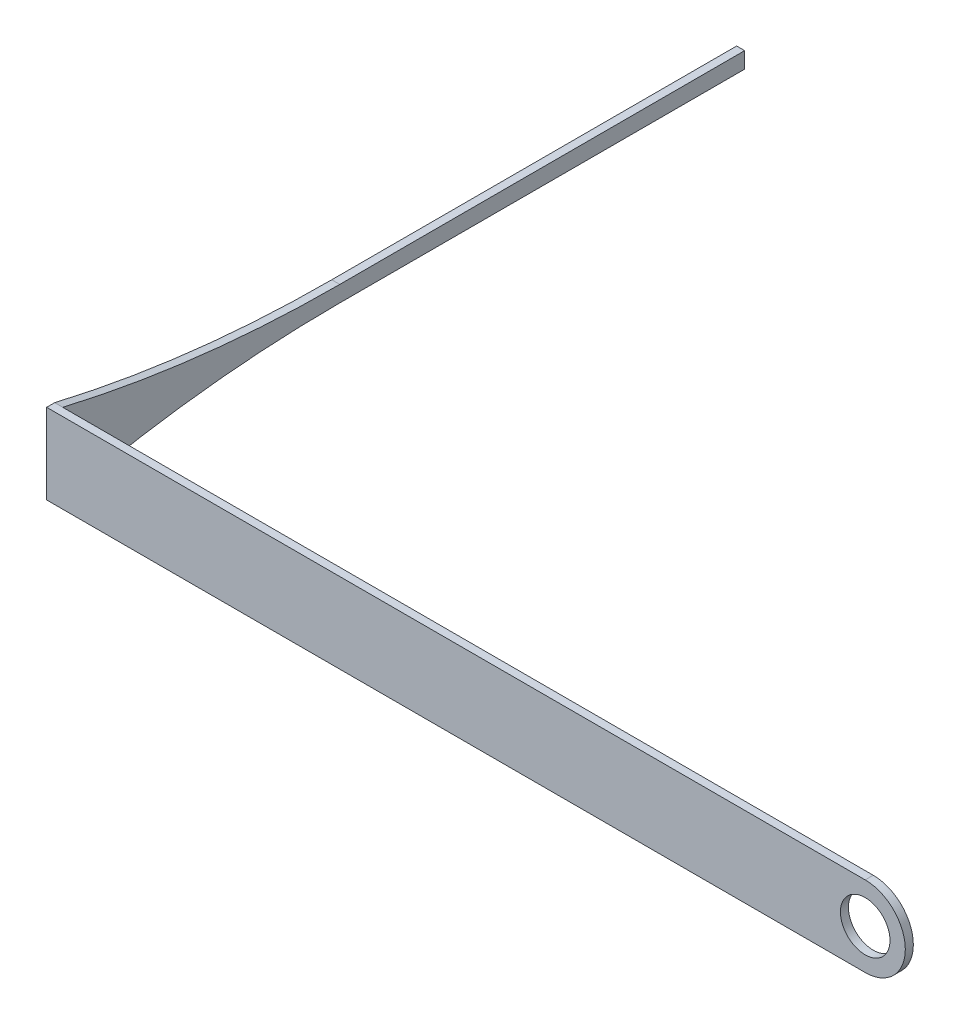
ISO-10303-21;
HEADER;
FILE_DESCRIPTION(('STEP AP214'),'2;1');
FILE_NAME('part.step','',(''),(''),'','','');
FILE_SCHEMA(('AUTOMOTIVE_DESIGN { 1 0 10303 214 1 1 1 1 }'));
ENDSEC;
DATA;
#1=APPLICATION_CONTEXT('core data for automotive mechanical design processes');
#2=APPLICATION_PROTOCOL_DEFINITION('international standard','automotive_design',2000,#1);
#3=PRODUCT_CONTEXT('',#1,'mechanical');
#4=PRODUCT('Part','Part','',(#3));
#5=PRODUCT_RELATED_PRODUCT_CATEGORY('part','',(#4));
#6=PRODUCT_DEFINITION_FORMATION('','',#4);
#7=PRODUCT_DEFINITION_CONTEXT('part definition',#1,'design');
#8=PRODUCT_DEFINITION('design','',#6,#7);
#9=PRODUCT_DEFINITION_SHAPE('','',#8);
#10=(LENGTH_UNIT() NAMED_UNIT(*) SI_UNIT(.MILLI.,.METRE.));
#11=(NAMED_UNIT(*) PLANE_ANGLE_UNIT() SI_UNIT($,.RADIAN.));
#12=(NAMED_UNIT(*) SI_UNIT($,.STERADIAN.) SOLID_ANGLE_UNIT());
#13=UNCERTAINTY_MEASURE_WITH_UNIT(LENGTH_MEASURE(1.E-05),#10,'distance_accuracy_value','');
#14=(GEOMETRIC_REPRESENTATION_CONTEXT(3) GLOBAL_UNCERTAINTY_ASSIGNED_CONTEXT((#13)) GLOBAL_UNIT_ASSIGNED_CONTEXT((#10,
#11,#12)) REPRESENTATION_CONTEXT('',''));
#15=CARTESIAN_POINT('',(0.,0.,0.));
#16=DIRECTION('',(0.,0.,1.));
#17=DIRECTION('',(1.,0.,0.));
#18=AXIS2_PLACEMENT_3D('',#15,#16,#17);
#19=CARTESIAN_POINT('',(-101.,5.,0.));
#20=DIRECTION('',(-1.,0.,0.));
#21=DIRECTION('',(0.,0.,1.));
#22=AXIS2_PLACEMENT_3D('',#19,#20,#21);
#23=PLANE('',#22);
#24=CARTESIAN_POINT('',(-101.,-152.017909025866,-34.527427824947));
#25=DIRECTION('',(-1.,0.,0.));
#26=DIRECTION('',(0.,0.,1.));
#27=AXIS2_PLACEMENT_3D('',#24,#25,#26);
#28=CIRCLE('',#27,151.017909025866);
#29=CARTESIAN_POINT('',(-101.,-1.,-34.527427824947));
#30=VERTEX_POINT('',#29);
#31=CARTESIAN_POINT('',(-101.,-5.,0.));
#32=VERTEX_POINT('',#31);
#33=EDGE_CURVE('E81',#30,#32,#28,.F.);
#34=ORIENTED_EDGE('',*,*,#33,.F.);
#35=DIRECTION('',(0.,0.,1.));
#36=VECTOR('',#35,1.);
#37=CARTESIAN_POINT('',(-101.,-1.,0.));
#38=LINE('',#37,#36);
#39=CARTESIAN_POINT('',(-101.,-1.,-84.9819117747086));
#40=VERTEX_POINT('',#39);
#41=EDGE_CURVE('E132',#40,#30,#38,.T.);
#42=ORIENTED_EDGE('',*,*,#41,.F.);
#43=DIRECTION('',(0.,-1.,0.));
#44=VECTOR('',#43,1.);
#45=CARTESIAN_POINT('',(-101.,5.,-84.9819117747086));
#46=LINE('',#45,#44);
#47=CARTESIAN_POINT('',(-101.,1.,-84.9819117747086));
#48=VERTEX_POINT('',#47);
#49=EDGE_CURVE('E117',#48,#40,#46,.T.);
#50=ORIENTED_EDGE('',*,*,#49,.F.);
#51=DIRECTION('',(0.,0.,-1.));
#52=VECTOR('',#51,1.);
#53=CARTESIAN_POINT('',(-101.,1.,0.));
#54=LINE('',#53,#52);
#55=CARTESIAN_POINT('',(-101.,1.,-34.527427824947));
#56=VERTEX_POINT('',#55);
#57=EDGE_CURVE('E124',#56,#48,#54,.T.);
#58=ORIENTED_EDGE('',*,*,#57,.F.);
#59=CARTESIAN_POINT('',(-101.,152.017909025866,-34.527427824947));
#60=DIRECTION('',(-1.,0.,0.));
#61=DIRECTION('',(0.,0.,1.));
#62=AXIS2_PLACEMENT_3D('',#59,#60,#61);
#63=CIRCLE('',#62,151.017909025866);
#64=CARTESIAN_POINT('',(-101.,5.,0.));
#65=VERTEX_POINT('',#64);
#66=EDGE_CURVE('E122',#56,#65,#63,.T.);
#67=ORIENTED_EDGE('',*,*,#66,.T.);
#68=DIRECTION('',(0.,-1.,0.));
#69=VECTOR('',#68,1.);
#70=CARTESIAN_POINT('',(-101.,5.,0.));
#71=LINE('',#70,#69);
#72=EDGE_CURVE('E87',#65,#32,#71,.T.);
#73=ORIENTED_EDGE('',*,*,#72,.T.);
#74=EDGE_LOOP('',(#34,#42,#50,#58,#67,#73));
#75=FACE_BOUND('',#74,.T.);
#76=ADVANCED_FACE('F35',(#75),#23,.F.);
#77=CARTESIAN_POINT('',(-102.,5.,-84.9819117747086));
#78=DIRECTION('',(0.,0.,1.));
#79=DIRECTION('',(1.,0.,0.));
#80=AXIS2_PLACEMENT_3D('',#77,#78,#79);
#81=PLANE('',#80);
#82=DIRECTION('',(-1.,0.,0.));
#83=VECTOR('',#82,1.);
#84=CARTESIAN_POINT('',(-92.,-1.,-84.9819117747086));
#85=LINE('',#84,#83);
#86=CARTESIAN_POINT('',(-102.,-1.,-84.9819117747086));
#87=VERTEX_POINT('',#86);
#88=EDGE_CURVE('E187',#40,#87,#85,.T.);
#89=ORIENTED_EDGE('',*,*,#88,.T.);
#90=DIRECTION('',(0.,-1.,0.));
#91=VECTOR('',#90,1.);
#92=CARTESIAN_POINT('',(-102.,5.,-84.9819117747086));
#93=LINE('',#92,#91);
#94=CARTESIAN_POINT('',(-102.,1.,-84.9819117747086));
#95=VERTEX_POINT('',#94);
#96=EDGE_CURVE('E114',#95,#87,#93,.T.);
#97=ORIENTED_EDGE('',*,*,#96,.F.);
#98=DIRECTION('',(1.,0.,0.));
#99=VECTOR('',#98,1.);
#100=CARTESIAN_POINT('',(-102.000012,1.,-84.9819117747086));
#101=LINE('',#100,#99);
#102=EDGE_CURVE('E97',#95,#48,#101,.T.);
#103=ORIENTED_EDGE('',*,*,#102,.T.);
#104=ORIENTED_EDGE('',*,*,#49,.T.);
#105=EDGE_LOOP('',(#89,#97,#103,#104));
#106=FACE_BOUND('',#105,.T.);
#107=ADVANCED_FACE('F198',(#106),#81,.F.);
#108=CARTESIAN_POINT('',(-102.,5.,1.00000000000001));
#109=DIRECTION('',(1.,0.,0.));
#110=DIRECTION('',(0.,0.,-1.));
#111=AXIS2_PLACEMENT_3D('',#108,#109,#110);
#112=PLANE('',#111);
#113=CARTESIAN_POINT('',(-102.,-152.017909025866,-34.527427824947));
#114=DIRECTION('',(-1.,0.,0.));
#115=DIRECTION('',(0.,0.,1.));
#116=AXIS2_PLACEMENT_3D('',#113,#114,#115);
#117=CIRCLE('',#116,151.017909025866);
#118=CARTESIAN_POINT('',(-102.,-1.,-34.527427824947));
#119=VERTEX_POINT('',#118);
#120=CARTESIAN_POINT('',(-102.,-5.,0.));
#121=VERTEX_POINT('',#120);
#122=EDGE_CURVE('E39',#119,#121,#117,.F.);
#123=ORIENTED_EDGE('',*,*,#122,.T.);
#124=DIRECTION('',(0.,0.,1.));
#125=VECTOR('',#124,1.);
#126=CARTESIAN_POINT('',(-102.,-5.,1.00000000000001));
#127=LINE('',#126,#125);
#128=CARTESIAN_POINT('',(-102.,-5.,1.00000000000001));
#129=VERTEX_POINT('',#128);
#130=EDGE_CURVE('E94',#121,#129,#127,.T.);
#131=ORIENTED_EDGE('',*,*,#130,.T.);
#132=DIRECTION('',(0.,-1.,0.));
#133=VECTOR('',#132,1.);
#134=CARTESIAN_POINT('',(-102.,5.,1.00000000000001));
#135=LINE('',#134,#133);
#136=CARTESIAN_POINT('',(-102.,5.,1.00000000000001));
#137=VERTEX_POINT('',#136);
#138=EDGE_CURVE('E112',#137,#129,#135,.T.);
#139=ORIENTED_EDGE('',*,*,#138,.F.);
#140=DIRECTION('',(0.,0.,1.));
#141=VECTOR('',#140,1.);
#142=CARTESIAN_POINT('',(-102.,5.,1.00000000000001));
#143=LINE('',#142,#141);
#144=CARTESIAN_POINT('',(-102.,5.,0.));
#145=VERTEX_POINT('',#144);
#146=EDGE_CURVE('E151',#145,#137,#143,.T.);
#147=ORIENTED_EDGE('',*,*,#146,.F.);
#148=CARTESIAN_POINT('',(-102.,152.017909025866,-34.527427824947));
#149=DIRECTION('',(-1.,0.,0.));
#150=DIRECTION('',(0.,0.,1.));
#151=AXIS2_PLACEMENT_3D('',#148,#149,#150);
#152=CIRCLE('',#151,151.017909025866);
#153=CARTESIAN_POINT('',(-102.,1.,-34.527427824947));
#154=VERTEX_POINT('',#153);
#155=EDGE_CURVE('E54',#154,#145,#152,.T.);
#156=ORIENTED_EDGE('',*,*,#155,.F.);
#157=DIRECTION('',(0.,0.,1.));
#158=VECTOR('',#157,1.);
#159=CARTESIAN_POINT('',(-102.,1.,1.00000000000001));
#160=LINE('',#159,#158);
#161=EDGE_CURVE('E45',#95,#154,#160,.T.);
#162=ORIENTED_EDGE('',*,*,#161,.F.);
#163=ORIENTED_EDGE('',*,*,#96,.T.);
#164=DIRECTION('',(0.,0.,-1.));
#165=VECTOR('',#164,1.);
#166=CARTESIAN_POINT('',(-102.,-1.,1.00000000000001));
#167=LINE('',#166,#165);
#168=EDGE_CURVE('E11',#119,#87,#167,.T.);
#169=ORIENTED_EDGE('',*,*,#168,.F.);
#170=EDGE_LOOP('',(#123,#131,#139,#147,#156,#162,#163,#169));
#171=FACE_BOUND('',#170,.T.);
#172=ADVANCED_FACE('F91',(#171),#112,.F.);
#173=CARTESIAN_POINT('',(0.,-5.,0.));
#174=DIRECTION('',(0.,-1.,0.));
#175=DIRECTION('',(0.,0.,-1.));
#176=AXIS2_PLACEMENT_3D('',#173,#174,#175);
#177=PLANE('',#176);
#178=ORIENTED_EDGE('',*,*,#130,.F.);
#179=DIRECTION('',(-1.,0.,0.));
#180=VECTOR('',#179,1.);
#181=CARTESIAN_POINT('',(-92.,-5.,0.));
#182=LINE('',#181,#180);
#183=EDGE_CURVE('E75',#121,#32,#182,.F.);
#184=ORIENTED_EDGE('',*,*,#183,.T.);
#185=DIRECTION('',(-1.,0.,0.));
#186=VECTOR('',#185,1.);
#187=CARTESIAN_POINT('',(0.,-5.,0.));
#188=LINE('',#187,#186);
#189=CARTESIAN_POINT('',(0.,-5.,0.));
#190=VERTEX_POINT('',#189);
#191=EDGE_CURVE('E103',#190,#32,#188,.T.);
#192=ORIENTED_EDGE('',*,*,#191,.F.);
#193=DIRECTION('',(0.,0.,-1.));
#194=VECTOR('',#193,1.);
#195=CARTESIAN_POINT('',(0.,-5.,0.));
#196=LINE('',#195,#194);
#197=CARTESIAN_POINT('',(0.,-5.,1.));
#198=VERTEX_POINT('',#197);
#199=EDGE_CURVE('E108',#198,#190,#196,.T.);
#200=ORIENTED_EDGE('',*,*,#199,.F.);
#201=DIRECTION('',(1.,0.,0.));
#202=VECTOR('',#201,1.);
#203=CARTESIAN_POINT('',(0.,-5.,1.));
#204=LINE('',#203,#202);
#205=EDGE_CURVE('E102',#129,#198,#204,.T.);
#206=ORIENTED_EDGE('',*,*,#205,.F.);
#207=EDGE_LOOP('',(#178,#184,#192,#200,#206));
#208=FACE_BOUND('',#207,.T.);
#209=ADVANCED_FACE('F99',(#208),#177,.T.);
#210=CARTESIAN_POINT('',(0.,5.,0.));
#211=DIRECTION('',(0.,0.,1.));
#212=DIRECTION('',(1.,0.,0.));
#213=AXIS2_PLACEMENT_3D('',#210,#211,#212);
#214=PLANE('',#213);
#215=CARTESIAN_POINT('',(0.,0.,0.));
#216=DIRECTION('',(0.,0.,1.));
#217=DIRECTION('',(1.,0.,0.));
#218=AXIS2_PLACEMENT_3D('',#215,#216,#217);
#219=CIRCLE('',#218,5.);
#220=CARTESIAN_POINT('',(0.,5.,0.));
#221=VERTEX_POINT('',#220);
#222=EDGE_CURVE('E138',#221,#190,#219,.F.);
#223=ORIENTED_EDGE('',*,*,#222,.T.);
#224=ORIENTED_EDGE('',*,*,#191,.T.);
#225=ORIENTED_EDGE('',*,*,#72,.F.);
#226=DIRECTION('',(-1.,0.,0.));
#227=VECTOR('',#226,1.);
#228=CARTESIAN_POINT('',(0.,5.,0.));
#229=LINE('',#228,#227);
#230=EDGE_CURVE('E148',#221,#65,#229,.T.);
#231=ORIENTED_EDGE('',*,*,#230,.F.);
#232=EDGE_LOOP('',(#223,#224,#225,#231));
#233=FACE_BOUND('',#232,.T.);
#234=CARTESIAN_POINT('',(0.,0.,0.));
#235=DIRECTION('',(0.,0.,1.));
#236=DIRECTION('',(1.,0.,0.));
#237=AXIS2_PLACEMENT_3D('',#234,#235,#236);
#238=CIRCLE('',#237,3.08891323509562);
#239=CARTESIAN_POINT('',(3.08891323509562,0.,0.));
#240=VERTEX_POINT('',#239);
#241=EDGE_CURVE('E135',#240,#240,#238,.F.);
#242=ORIENTED_EDGE('',*,*,#241,.F.);
#243=EDGE_LOOP('',(#242));
#244=FACE_BOUND('',#243,.T.);
#245=ADVANCED_FACE('F37',(#233,#244),#214,.F.);
#246=CARTESIAN_POINT('',(0.,5.,1.));
#247=DIRECTION('',(0.,0.,-1.));
#248=DIRECTION('',(-1.,0.,0.));
#249=AXIS2_PLACEMENT_3D('',#246,#247,#248);
#250=PLANE('',#249);
#251=CARTESIAN_POINT('',(0.,0.,1.));
#252=DIRECTION('',(0.,0.,1.));
#253=DIRECTION('',(1.,0.,0.));
#254=AXIS2_PLACEMENT_3D('',#251,#252,#253);
#255=CIRCLE('',#254,3.08891323509562);
#256=CARTESIAN_POINT('',(3.08891323509562,0.,1.));
#257=VERTEX_POINT('',#256);
#258=EDGE_CURVE('E139',#257,#257,#255,.T.);
#259=ORIENTED_EDGE('',*,*,#258,.F.);
#260=EDGE_LOOP('',(#259));
#261=FACE_BOUND('',#260,.T.);
#262=ORIENTED_EDGE('',*,*,#205,.T.);
#263=CARTESIAN_POINT('',(0.,0.,1.));
#264=DIRECTION('',(0.,0.,1.));
#265=DIRECTION('',(1.,0.,0.));
#266=AXIS2_PLACEMENT_3D('',#263,#264,#265);
#267=CIRCLE('',#266,5.);
#268=CARTESIAN_POINT('',(0.,5.,1.));
#269=VERTEX_POINT('',#268);
#270=EDGE_CURVE('E134',#198,#269,#267,.T.);
#271=ORIENTED_EDGE('',*,*,#270,.T.);
#272=DIRECTION('',(1.,0.,0.));
#273=VECTOR('',#272,1.);
#274=CARTESIAN_POINT('',(0.,5.,1.));
#275=LINE('',#274,#273);
#276=EDGE_CURVE('E115',#137,#269,#275,.T.);
#277=ORIENTED_EDGE('',*,*,#276,.F.);
#278=ORIENTED_EDGE('',*,*,#138,.T.);
#279=EDGE_LOOP('',(#262,#271,#277,#278));
#280=FACE_BOUND('',#279,.T.);
#281=ADVANCED_FACE('F211',(#261,#280),#250,.F.);
#282=CARTESIAN_POINT('',(0.,5.,0.));
#283=DIRECTION('',(0.,-1.,0.));
#284=DIRECTION('',(0.,0.,-1.));
#285=AXIS2_PLACEMENT_3D('',#282,#283,#284);
#286=PLANE('',#285);
#287=ORIENTED_EDGE('',*,*,#230,.T.);
#288=DIRECTION('',(-1.,0.,0.));
#289=VECTOR('',#288,1.);
#290=CARTESIAN_POINT('',(-92.,5.,0.));
#291=LINE('',#290,#289);
#292=EDGE_CURVE('E86',#65,#145,#291,.T.);
#293=ORIENTED_EDGE('',*,*,#292,.T.);
#294=ORIENTED_EDGE('',*,*,#146,.T.);
#295=ORIENTED_EDGE('',*,*,#276,.T.);
#296=DIRECTION('',(0.,0.,-1.));
#297=VECTOR('',#296,1.);
#298=CARTESIAN_POINT('',(0.,5.,0.));
#299=LINE('',#298,#297);
#300=EDGE_CURVE('E105',#269,#221,#299,.T.);
#301=ORIENTED_EDGE('',*,*,#300,.T.);
#302=EDGE_LOOP('',(#287,#293,#294,#295,#301));
#303=FACE_BOUND('',#302,.T.);
#304=ADVANCED_FACE('F207',(#303),#286,.F.);
#305=CARTESIAN_POINT('',(0.,0.,-11.1803398874989));
#306=DIRECTION('',(0.,0.,1.));
#307=DIRECTION('',(1.,0.,0.));
#308=AXIS2_PLACEMENT_3D('',#305,#306,#307);
#309=CYLINDRICAL_SURFACE('',#308,3.08891323509562);
#310=ORIENTED_EDGE('',*,*,#258,.T.);
#311=EDGE_LOOP('',(#310));
#312=FACE_BOUND('',#311,.T.);
#313=ORIENTED_EDGE('',*,*,#241,.T.);
#314=EDGE_LOOP('',(#313));
#315=FACE_BOUND('',#314,.T.);
#316=ADVANCED_FACE('F219',(#312,#315),#309,.F.);
#317=CARTESIAN_POINT('',(0.,0.,-11.1803398874989));
#318=DIRECTION('',(0.,0.,1.));
#319=DIRECTION('',(1.,0.,0.));
#320=AXIS2_PLACEMENT_3D('',#317,#318,#319);
#321=CYLINDRICAL_SURFACE('',#320,5.);
#322=ORIENTED_EDGE('',*,*,#222,.F.);
#323=ORIENTED_EDGE('',*,*,#300,.F.);
#324=ORIENTED_EDGE('',*,*,#270,.F.);
#325=ORIENTED_EDGE('',*,*,#199,.T.);
#326=EDGE_LOOP('',(#322,#323,#324,#325));
#327=FACE_BOUND('',#326,.T.);
#328=ADVANCED_FACE('F159',(#327),#321,.T.);
#329=CARTESIAN_POINT('',(-92.,-1.,0.));
#330=DIRECTION('',(0.,-1.,0.));
#331=DIRECTION('',(0.,0.,-1.));
#332=AXIS2_PLACEMENT_3D('',#329,#330,#331);
#333=PLANE('',#332);
#334=ORIENTED_EDGE('',*,*,#41,.T.);
#335=DIRECTION('',(-1.,0.,0.));
#336=VECTOR('',#335,1.);
#337=CARTESIAN_POINT('',(-92.,-1.,-34.527427824947));
#338=LINE('',#337,#336);
#339=EDGE_CURVE('E67',#30,#119,#338,.T.);
#340=ORIENTED_EDGE('',*,*,#339,.T.);
#341=ORIENTED_EDGE('',*,*,#168,.T.);
#342=ORIENTED_EDGE('',*,*,#88,.F.);
#343=EDGE_LOOP('',(#334,#340,#341,#342));
#344=FACE_BOUND('',#343,.T.);
#345=ADVANCED_FACE('F189',(#344),#333,.T.);
#346=CARTESIAN_POINT('',(-92.,-152.017909025866,-34.527427824947));
#347=DIRECTION('',(-1.,0.,0.));
#348=DIRECTION('',(0.,0.,1.));
#349=AXIS2_PLACEMENT_3D('',#346,#347,#348);
#350=CYLINDRICAL_SURFACE('',#349,151.017909025866);
#351=ORIENTED_EDGE('',*,*,#33,.T.);
#352=ORIENTED_EDGE('',*,*,#183,.F.);
#353=ORIENTED_EDGE('',*,*,#122,.F.);
#354=ORIENTED_EDGE('',*,*,#339,.F.);
#355=EDGE_LOOP('',(#351,#352,#353,#354));
#356=FACE_BOUND('',#355,.T.);
#357=ADVANCED_FACE('F77',(#356),#350,.F.);
#358=CARTESIAN_POINT('',(-102.000012,1.,0.));
#359=DIRECTION('',(0.,1.,0.));
#360=DIRECTION('',(0.,0.,1.));
#361=AXIS2_PLACEMENT_3D('',#358,#359,#360);
#362=PLANE('',#361);
#363=ORIENTED_EDGE('',*,*,#57,.T.);
#364=ORIENTED_EDGE('',*,*,#102,.F.);
#365=ORIENTED_EDGE('',*,*,#161,.T.);
#366=DIRECTION('',(-1.,0.,0.));
#367=VECTOR('',#366,1.);
#368=CARTESIAN_POINT('',(-92.,1.,-34.527427824947));
#369=LINE('',#368,#367);
#370=EDGE_CURVE('E192',#56,#154,#369,.T.);
#371=ORIENTED_EDGE('',*,*,#370,.F.);
#372=EDGE_LOOP('',(#363,#364,#365,#371));
#373=FACE_BOUND('',#372,.T.);
#374=ADVANCED_FACE('F241',(#373),#362,.T.);
#375=CARTESIAN_POINT('',(-92.,152.017909025866,-34.527427824947));
#376=DIRECTION('',(-1.,0.,0.));
#377=DIRECTION('',(0.,0.,1.));
#378=AXIS2_PLACEMENT_3D('',#375,#376,#377);
#379=CYLINDRICAL_SURFACE('',#378,151.017909025866);
#380=ORIENTED_EDGE('',*,*,#370,.T.);
#381=ORIENTED_EDGE('',*,*,#155,.T.);
#382=ORIENTED_EDGE('',*,*,#292,.F.);
#383=ORIENTED_EDGE('',*,*,#66,.F.);
#384=EDGE_LOOP('',(#380,#381,#382,#383));
#385=FACE_BOUND('',#384,.T.);
#386=ADVANCED_FACE('F203',(#385),#379,.F.);
#387=CLOSED_SHELL('',(#76,#107,#172,#209,#245,#281,#304,#316,#328,#345,#357,#374,#386));
#388=MANIFOLD_SOLID_BREP('B2',#387);
#389=ADVANCED_BREP_SHAPE_REPRESENTATION('',(#18,#388),#14);
#390=SHAPE_DEFINITION_REPRESENTATION(#9,#389);
ENDSEC;
END-ISO-10303-21;
